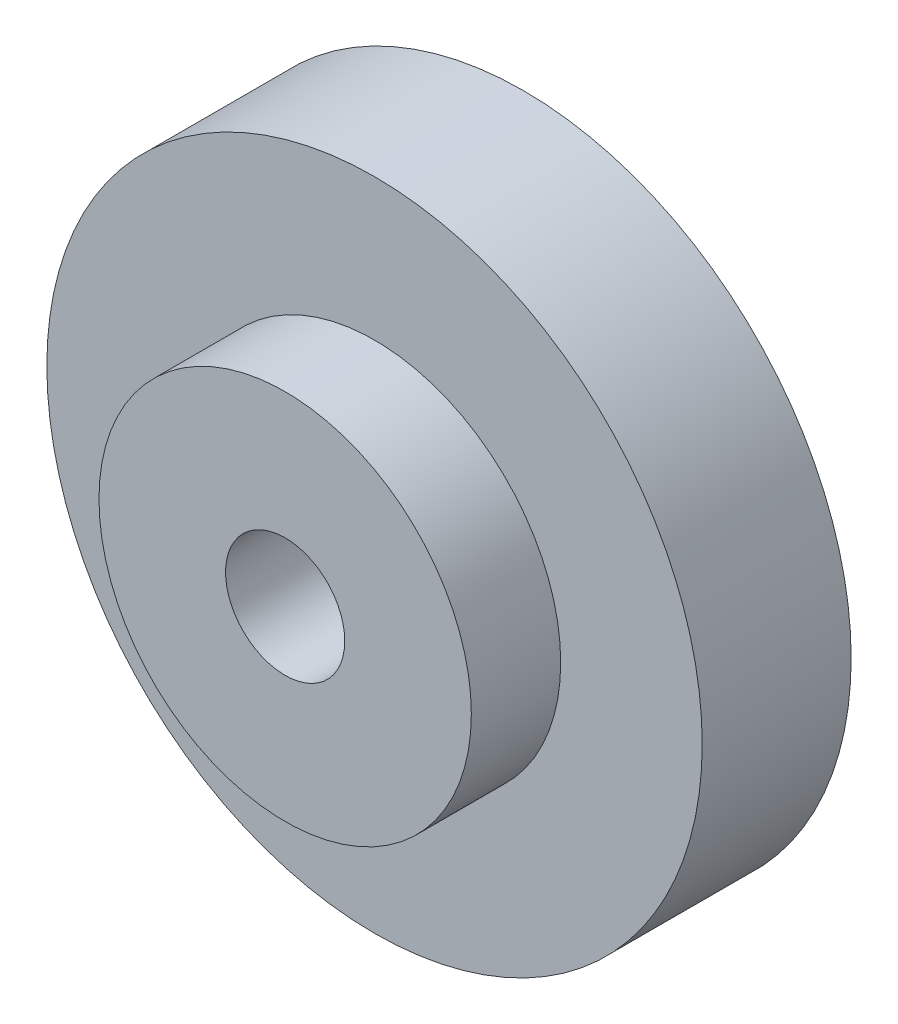
ISO-10303-21;
HEADER;
FILE_DESCRIPTION(('STEP AP214'),'2;1');
FILE_NAME('part.step','',(''),(''),'','','');
FILE_SCHEMA(('AUTOMOTIVE_DESIGN { 1 0 10303 214 1 1 1 1 }'));
ENDSEC;
DATA;
#1=APPLICATION_CONTEXT('core data for automotive mechanical design processes');
#2=APPLICATION_PROTOCOL_DEFINITION('international standard','automotive_design',2000,#1);
#3=PRODUCT_CONTEXT('',#1,'mechanical');
#4=PRODUCT('Part','Part','',(#3));
#5=PRODUCT_RELATED_PRODUCT_CATEGORY('part','',(#4));
#6=PRODUCT_DEFINITION_FORMATION('','',#4);
#7=PRODUCT_DEFINITION_CONTEXT('part definition',#1,'design');
#8=PRODUCT_DEFINITION('design','',#6,#7);
#9=PRODUCT_DEFINITION_SHAPE('','',#8);
#10=(LENGTH_UNIT() NAMED_UNIT(*) SI_UNIT(.MILLI.,.METRE.));
#11=(NAMED_UNIT(*) PLANE_ANGLE_UNIT() SI_UNIT($,.RADIAN.));
#12=(NAMED_UNIT(*) SI_UNIT($,.STERADIAN.) SOLID_ANGLE_UNIT());
#13=UNCERTAINTY_MEASURE_WITH_UNIT(LENGTH_MEASURE(1.E-05),#10,'distance_accuracy_value','');
#14=(GEOMETRIC_REPRESENTATION_CONTEXT(3) GLOBAL_UNCERTAINTY_ASSIGNED_CONTEXT((#13)) GLOBAL_UNIT_ASSIGNED_CONTEXT((#10,
#11,#12)) REPRESENTATION_CONTEXT('',''));
#15=CARTESIAN_POINT('',(0.,0.,0.));
#16=DIRECTION('',(0.,0.,1.));
#17=DIRECTION('',(1.,0.,0.));
#18=AXIS2_PLACEMENT_3D('',#15,#16,#17);
#19=CARTESIAN_POINT('',(0.,0.,10.));
#20=DIRECTION('',(0.,0.,1.));
#21=DIRECTION('',(1.,0.,0.));
#22=AXIS2_PLACEMENT_3D('',#19,#20,#21);
#23=PLANE('',#22);
#24=CARTESIAN_POINT('',(0.,0.,10.));
#25=DIRECTION('',(0.,0.,1.));
#26=DIRECTION('',(1.,0.,0.));
#27=AXIS2_PLACEMENT_3D('',#24,#25,#26);
#28=CIRCLE('',#27,22.);
#29=CARTESIAN_POINT('',(22.,0.,10.));
#30=VERTEX_POINT('',#29);
#31=EDGE_CURVE('E10',#30,#30,#28,.T.);
#32=ORIENTED_EDGE('',*,*,#31,.T.);
#33=EDGE_LOOP('',(#32));
#34=FACE_BOUND('',#33,.T.);
#35=CARTESIAN_POINT('',(0.,0.,10.));
#36=DIRECTION('',(0.,0.,1.));
#37=DIRECTION('',(1.,0.,0.));
#38=AXIS2_PLACEMENT_3D('',#35,#36,#37);
#39=CIRCLE('',#38,12.5);
#40=CARTESIAN_POINT('',(12.5,0.,10.));
#41=VERTEX_POINT('',#40);
#42=EDGE_CURVE('E47',#41,#41,#39,.T.);
#43=ORIENTED_EDGE('',*,*,#42,.F.);
#44=EDGE_LOOP('',(#43));
#45=FACE_BOUND('',#44,.T.);
#46=ADVANCED_FACE('F31',(#34,#45),#23,.T.);
#47=CARTESIAN_POINT('',(0.,0.,0.));
#48=DIRECTION('',(0.,0.,1.));
#49=DIRECTION('',(1.,0.,0.));
#50=AXIS2_PLACEMENT_3D('',#47,#48,#49);
#51=PLANE('',#50);
#52=CARTESIAN_POINT('',(0.,0.,0.));
#53=DIRECTION('',(0.,0.,1.));
#54=DIRECTION('',(1.,0.,0.));
#55=AXIS2_PLACEMENT_3D('',#52,#53,#54);
#56=CIRCLE('',#55,22.);
#57=CARTESIAN_POINT('',(22.,0.,0.));
#58=VERTEX_POINT('',#57);
#59=EDGE_CURVE('E35',#58,#58,#56,.T.);
#60=ORIENTED_EDGE('',*,*,#59,.F.);
#61=EDGE_LOOP('',(#60));
#62=FACE_BOUND('',#61,.T.);
#63=CARTESIAN_POINT('',(0.,0.,0.));
#64=DIRECTION('',(0.,0.,1.));
#65=DIRECTION('',(1.,0.,0.));
#66=AXIS2_PLACEMENT_3D('',#63,#64,#65);
#67=CIRCLE('',#66,4.);
#68=CARTESIAN_POINT('',(4.,0.,0.));
#69=VERTEX_POINT('',#68);
#70=EDGE_CURVE('E42',#69,#69,#67,.T.);
#71=ORIENTED_EDGE('',*,*,#70,.T.);
#72=EDGE_LOOP('',(#71));
#73=FACE_BOUND('',#72,.T.);
#74=ADVANCED_FACE('F72',(#62,#73),#51,.F.);
#75=CARTESIAN_POINT('',(0.,0.,10.));
#76=DIRECTION('',(0.,0.,-1.));
#77=DIRECTION('',(-1.,0.,0.));
#78=AXIS2_PLACEMENT_3D('',#75,#76,#77);
#79=CYLINDRICAL_SURFACE('',#78,22.);
#80=ORIENTED_EDGE('',*,*,#31,.F.);
#81=EDGE_LOOP('',(#80));
#82=FACE_BOUND('',#81,.T.);
#83=ORIENTED_EDGE('',*,*,#59,.T.);
#84=EDGE_LOOP('',(#83));
#85=FACE_BOUND('',#84,.T.);
#86=ADVANCED_FACE('F33',(#82,#85),#79,.T.);
#87=CARTESIAN_POINT('',(0.,0.,10.));
#88=DIRECTION('',(0.,0.,-1.));
#89=DIRECTION('',(-1.,0.,0.));
#90=AXIS2_PLACEMENT_3D('',#87,#88,#89);
#91=CYLINDRICAL_SURFACE('',#90,4.);
#92=ORIENTED_EDGE('',*,*,#70,.F.);
#93=EDGE_LOOP('',(#92));
#94=FACE_BOUND('',#93,.T.);
#95=CARTESIAN_POINT('',(0.,0.,16.));
#96=DIRECTION('',(0.,0.,1.));
#97=DIRECTION('',(1.,0.,0.));
#98=AXIS2_PLACEMENT_3D('',#95,#96,#97);
#99=CIRCLE('',#98,4.);
#100=CARTESIAN_POINT('',(4.,0.,16.));
#101=VERTEX_POINT('',#100);
#102=EDGE_CURVE('E50',#101,#101,#99,.T.);
#103=ORIENTED_EDGE('',*,*,#102,.T.);
#104=EDGE_LOOP('',(#103));
#105=FACE_BOUND('',#104,.T.);
#106=ADVANCED_FACE('F56',(#94,#105),#91,.F.);
#107=CARTESIAN_POINT('',(0.,0.,16.));
#108=DIRECTION('',(0.,0.,1.));
#109=DIRECTION('',(1.,0.,0.));
#110=AXIS2_PLACEMENT_3D('',#107,#108,#109);
#111=PLANE('',#110);
#112=CARTESIAN_POINT('',(0.,0.,16.));
#113=DIRECTION('',(0.,0.,1.));
#114=DIRECTION('',(1.,0.,0.));
#115=AXIS2_PLACEMENT_3D('',#112,#113,#114);
#116=CIRCLE('',#115,12.5);
#117=CARTESIAN_POINT('',(12.5,0.,16.));
#118=VERTEX_POINT('',#117);
#119=EDGE_CURVE('E46',#118,#118,#116,.T.);
#120=ORIENTED_EDGE('',*,*,#119,.T.);
#121=EDGE_LOOP('',(#120));
#122=FACE_BOUND('',#121,.T.);
#123=ORIENTED_EDGE('',*,*,#102,.F.);
#124=EDGE_LOOP('',(#123));
#125=FACE_BOUND('',#124,.T.);
#126=ADVANCED_FACE('F58',(#122,#125),#111,.T.);
#127=CARTESIAN_POINT('',(0.,0.,16.));
#128=DIRECTION('',(0.,0.,-1.));
#129=DIRECTION('',(-1.,0.,0.));
#130=AXIS2_PLACEMENT_3D('',#127,#128,#129);
#131=CYLINDRICAL_SURFACE('',#130,12.5);
#132=ORIENTED_EDGE('',*,*,#119,.F.);
#133=EDGE_LOOP('',(#132));
#134=FACE_BOUND('',#133,.T.);
#135=ORIENTED_EDGE('',*,*,#42,.T.);
#136=EDGE_LOOP('',(#135));
#137=FACE_BOUND('',#136,.T.);
#138=ADVANCED_FACE('F60',(#134,#137),#131,.T.);
#139=CLOSED_SHELL('',(#46,#74,#86,#106,#126,#138));
#140=MANIFOLD_SOLID_BREP('B2',#139);
#141=ADVANCED_BREP_SHAPE_REPRESENTATION('',(#18,#140),#14);
#142=SHAPE_DEFINITION_REPRESENTATION(#9,#141);
ENDSEC;
END-ISO-10303-21;
